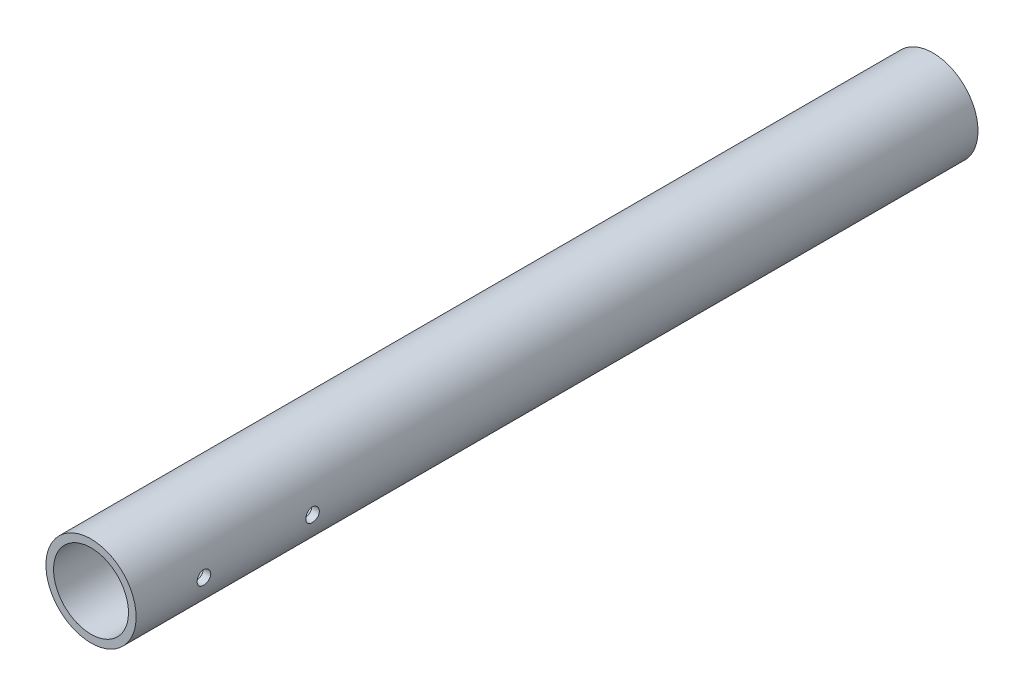
ISO-10303-21;
HEADER;
FILE_DESCRIPTION(('STEP AP214'),'2;1');
FILE_NAME('part.step','',(''),(''),'','','');
FILE_SCHEMA(('AUTOMOTIVE_DESIGN { 1 0 10303 214 1 1 1 1 }'));
ENDSEC;
DATA;
#1=APPLICATION_CONTEXT('core data for automotive mechanical design processes');
#2=APPLICATION_PROTOCOL_DEFINITION('international standard','automotive_design',2000,#1);
#3=PRODUCT_CONTEXT('',#1,'mechanical');
#4=PRODUCT('Part','Part','',(#3));
#5=PRODUCT_RELATED_PRODUCT_CATEGORY('part','',(#4));
#6=PRODUCT_DEFINITION_FORMATION('','',#4);
#7=PRODUCT_DEFINITION_CONTEXT('part definition',#1,'design');
#8=PRODUCT_DEFINITION('design','',#6,#7);
#9=PRODUCT_DEFINITION_SHAPE('','',#8);
#10=(LENGTH_UNIT() NAMED_UNIT(*) SI_UNIT(.MILLI.,.METRE.));
#11=(NAMED_UNIT(*) PLANE_ANGLE_UNIT() SI_UNIT($,.RADIAN.));
#12=(NAMED_UNIT(*) SI_UNIT($,.STERADIAN.) SOLID_ANGLE_UNIT());
#13=UNCERTAINTY_MEASURE_WITH_UNIT(LENGTH_MEASURE(1.E-05),#10,'distance_accuracy_value','');
#14=(GEOMETRIC_REPRESENTATION_CONTEXT(3) GLOBAL_UNCERTAINTY_ASSIGNED_CONTEXT((#13)) GLOBAL_UNIT_ASSIGNED_CONTEXT((#10,
#11,#12)) REPRESENTATION_CONTEXT('',''));
#15=CARTESIAN_POINT('',(0.,0.,0.));
#16=DIRECTION('',(0.,0.,1.));
#17=DIRECTION('',(1.,0.,0.));
#18=AXIS2_PLACEMENT_3D('',#15,#16,#17);
#19=CARTESIAN_POINT('',(0.,0.,0.));
#20=DIRECTION('',(0.,0.,1.));
#21=DIRECTION('',(1.,0.,0.));
#22=AXIS2_PLACEMENT_3D('',#19,#20,#21);
#23=CYLINDRICAL_SURFACE('',#22,17.526);
#24=CARTESIAN_POINT('',(0.,0.,393.7));
#25=DIRECTION('',(0.,0.,1.));
#26=DIRECTION('',(1.,0.,0.));
#27=AXIS2_PLACEMENT_3D('',#24,#25,#26);
#28=CIRCLE('',#27,17.526);
#29=CARTESIAN_POINT('',(17.526,0.,393.7));
#30=VERTEX_POINT('',#29);
#31=EDGE_CURVE('E18',#30,#30,#28,.F.);
#32=ORIENTED_EDGE('',*,*,#31,.F.);
#33=EDGE_LOOP('',(#32));
#34=FACE_BOUND('',#33,.T.);
#35=CARTESIAN_POINT('',(0.,0.,0.));
#36=DIRECTION('',(0.,0.,1.));
#37=DIRECTION('',(1.,0.,0.));
#38=AXIS2_PLACEMENT_3D('',#35,#36,#37);
#39=CIRCLE('',#38,17.526);
#40=CARTESIAN_POINT('',(17.526,0.,0.));
#41=VERTEX_POINT('',#40);
#42=EDGE_CURVE('E78',#41,#41,#39,.F.);
#43=ORIENTED_EDGE('',*,*,#42,.T.);
#44=EDGE_LOOP('',(#43));
#45=FACE_BOUND('',#44,.T.);
#46=CARTESIAN_POINT('',(17.526,0.,314.325));
#47=CARTESIAN_POINT('',(17.5259963175726,-0.176613181051217,314.324991723302));
#48=CARTESIAN_POINT('',(17.5233002826582,-0.353449171258817,314.310200668148));
#49=CARTESIAN_POINT('',(17.5127973362593,-0.702281908474051,314.251423100833));
#50=CARTESIAN_POINT('',(17.5049801575711,-0.874268208471723,314.207377935658));
#51=CARTESIAN_POINT('',(17.48511038614,-1.20810250721723,314.09147464681));
#52=CARTESIAN_POINT('',(17.473063368271,-1.36996352173552,314.019653119444));
#53=CARTESIAN_POINT('',(17.4460554580361,-1.67927316437237,313.850324943954));
#54=CARTESIAN_POINT('',(17.4310956012814,-1.82672688686375,313.752827420172));
#55=CARTESIAN_POINT('',(17.3997238299546,-2.10477719057218,313.533732397024));
#56=CARTESIAN_POINT('',(17.3832987194985,-2.23518750324315,313.411900352404));
#57=CARTESIAN_POINT('',(17.3509459564745,-2.4738411468331,313.14809368207));
#58=CARTESIAN_POINT('',(17.335018364459,-2.58208178835293,313.006116616098));
#59=CARTESIAN_POINT('',(17.3053385875312,-2.77407123838613,312.704766903283));
#60=CARTESIAN_POINT('',(17.2916032051447,-2.85763469507356,312.545274368621));
#61=CARTESIAN_POINT('',(17.2680458993697,-2.99671051245855,312.214226026226));
#62=CARTESIAN_POINT('',(17.2582236283197,-3.05222536525872,312.042671291755));
#63=CARTESIAN_POINT('',(17.2437354897132,-3.13304106760211,311.694333560972));
#64=CARTESIAN_POINT('',(17.2390149777777,-3.15866234519934,311.517627222411));
#65=CARTESIAN_POINT('',(17.2350999262051,-3.17995782709565,311.162365293601));
#66=CARTESIAN_POINT('',(17.2359049331653,-3.17563448853508,310.983809856282));
#67=CARTESIAN_POINT('',(17.2429001543548,-3.13742373793371,310.632230746528));
#68=CARTESIAN_POINT('',(17.2490242048828,-3.10389954139066,310.459166088615));
#69=CARTESIAN_POINT('',(17.2658637551246,-3.00880960849846,310.121157532169));
#70=CARTESIAN_POINT('',(17.276579474651,-2.94724252966902,309.956214022834));
#71=CARTESIAN_POINT('',(17.3014652665683,-2.79745291276667,309.638055892979));
#72=CARTESIAN_POINT('',(17.3156545368537,-2.70908155858381,309.484912899375));
#73=CARTESIAN_POINT('',(17.3458743890737,-2.50830442996264,309.195503775616));
#74=CARTESIAN_POINT('',(17.3619050065012,-2.39589819220297,309.059237970883));
#75=CARTESIAN_POINT('',(17.3942883351767,-2.14829928114741,308.805361728415));
#76=CARTESIAN_POINT('',(17.4106423451863,-2.01279967929529,308.688050627084));
#77=CARTESIAN_POINT('',(17.4416233292778,-1.72381393754225,308.477729015706));
#78=CARTESIAN_POINT('',(17.4562495353167,-1.57031985869497,308.38472929043));
#79=CARTESIAN_POINT('',(17.4821550853627,-1.24935860544027,308.22563859958));
#80=CARTESIAN_POINT('',(17.4934280108005,-1.08186540977745,308.159599150311));
#81=CARTESIAN_POINT('',(17.5112904348231,-0.738132155126105,308.056807400917));
#82=CARTESIAN_POINT('',(17.5178897862262,-0.561911340494518,308.019993467668));
#83=CARTESIAN_POINT('',(17.5231896350432,-0.320322833927916,307.990545032544));
#84=CARTESIAN_POINT('',(17.5242412276541,-0.256410066392405,307.984720466382));
#85=CARTESIAN_POINT('',(17.5256470796399,-0.128341342038203,307.976946444097));
#86=CARTESIAN_POINT('',(17.5260013382808,-0.064185384963603,307.974996992053));
#87=CARTESIAN_POINT('',(17.5259963175725,0.176613181051215,307.975008276698));
#88=CARTESIAN_POINT('',(17.5233002826582,0.353449171258822,307.989799331852));
#89=CARTESIAN_POINT('',(17.5127973362593,0.702281908474058,308.048576899167));
#90=CARTESIAN_POINT('',(17.5049801575711,0.874268208471724,308.092622064342));
#91=CARTESIAN_POINT('',(17.48511038614,1.20810250721723,308.20852535319));
#92=CARTESIAN_POINT('',(17.473063368271,1.36996352173552,308.280346880556));
#93=CARTESIAN_POINT('',(17.4460554580361,1.67927316437237,308.449675056046));
#94=CARTESIAN_POINT('',(17.4310956012814,1.82672688686375,308.547172579828));
#95=CARTESIAN_POINT('',(17.3997238299546,2.10477719057218,308.766267602976));
#96=CARTESIAN_POINT('',(17.3832987194985,2.23518750324315,308.888099647596));
#97=CARTESIAN_POINT('',(17.3509459564745,2.4738411468331,309.15190631793));
#98=CARTESIAN_POINT('',(17.335018364459,2.58208178835293,309.293883383902));
#99=CARTESIAN_POINT('',(17.3053385875312,2.77407123838613,309.595233096717));
#100=CARTESIAN_POINT('',(17.2916032051447,2.85763469507356,309.754725631379));
#101=CARTESIAN_POINT('',(17.2680458993697,2.99671051245855,310.085773973774));
#102=CARTESIAN_POINT('',(17.2582236283197,3.05222536525872,310.257328708245));
#103=CARTESIAN_POINT('',(17.2437354897132,3.13304106760211,310.605666439028));
#104=CARTESIAN_POINT('',(17.2390149777777,3.15866234519934,310.782372777589));
#105=CARTESIAN_POINT('',(17.2350999262051,3.17995782709565,311.137634706399));
#106=CARTESIAN_POINT('',(17.2359049331653,3.17563448853508,311.316190143718));
#107=CARTESIAN_POINT('',(17.2429001543548,3.13742373793371,311.667769253472));
#108=CARTESIAN_POINT('',(17.2490242048828,3.10389954139064,311.840833911385));
#109=CARTESIAN_POINT('',(17.2658637551246,3.00880960849844,312.178842467831));
#110=CARTESIAN_POINT('',(17.276579474651,2.947242529669,312.343785977166));
#111=CARTESIAN_POINT('',(17.3014652665683,2.79745291276668,312.661944107021));
#112=CARTESIAN_POINT('',(17.3156545368537,2.70908155858381,312.815087100625));
#113=CARTESIAN_POINT('',(17.3458743890737,2.50830442996264,313.104496224384));
#114=CARTESIAN_POINT('',(17.3619050065012,2.39589819220297,313.240762029117));
#115=CARTESIAN_POINT('',(17.3942883351767,2.14829928114741,313.494638271585));
#116=CARTESIAN_POINT('',(17.4106423451863,2.01279967929529,313.611949372916));
#117=CARTESIAN_POINT('',(17.4416233292778,1.72381393754225,313.822270984294));
#118=CARTESIAN_POINT('',(17.4562495353167,1.57031985869498,313.91527070957));
#119=CARTESIAN_POINT('',(17.4821550853627,1.24935860544028,314.07436140042));
#120=CARTESIAN_POINT('',(17.4934280108005,1.08186540977744,314.140400849689));
#121=CARTESIAN_POINT('',(17.5112904348231,0.738132155126103,314.243192599083));
#122=CARTESIAN_POINT('',(17.5178897862262,0.561911340494523,314.280006532332));
#123=CARTESIAN_POINT('',(17.5231896350432,0.320322833927918,314.309454967456));
#124=CARTESIAN_POINT('',(17.5242412276541,0.256410066392406,314.315279533618));
#125=CARTESIAN_POINT('',(17.5256470796399,0.1283413420382,314.323053555903));
#126=CARTESIAN_POINT('',(17.5260013382808,0.0641853849635972,314.325003007947));
#127=CARTESIAN_POINT('',(17.526,0.,314.325));
#128=B_SPLINE_CURVE_WITH_KNOTS('',3,(#46,#47,#48,#49,#50,#51,#52,#53,#54,#55,#56,#57,#58,#59,
#60,#61,#62,#63,#64,#65,#66,#67,#68,#69,#70,#71,#72,#73,#74,#75,#76,#77,#78,#79,#80,#81,#82,#83,
#84,#85,#86,#87,#88,#89,#90,#91,#92,#93,#94,#95,#96,#97,#98,#99,#100,#101,#102,#103,#104,#105,
#106,#107,#108,#109,#110,#111,#112,#113,#114,#115,#116,#117,#118,#119,#120,#121,#122,#123,#124,
#125,#126,#127),.UNSPECIFIED.,.T.,.F.,(4,2,2,2,2,2,2,2,2,2,2,2,2,2,2,2,2,2,2,2,2,2,2,2,2,2,2,2,
2,2,2,2,2,2,2,2,2,2,2,2,4),(0.,0.529594384353553,1.06025379692027,1.59021641642847,
2.11999095947089,2.6551421139281,3.19035814908337,3.72949754433927,4.26858902893715,
4.80184732449042,5.33506186343168,5.86173721299796,6.3884377784318,6.91811781642991,
7.44780806601106,7.98518312810164,8.52279617220148,9.06143174460417,9.59892835876537,
9.79139521459187,9.98386227300715,10.5134566573607,11.0441160699274,11.5740786894356,
12.103853232478,12.6390043869353,13.1742204220905,13.7133598173464,14.2524513019443,
14.7857095974976,15.3189241364388,15.8455994860052,16.372300051439,16.9019800894371,
17.4316703390182,17.9690454011088,18.5066584452086,19.0452940176113,19.5827906317725,
19.775257487599,19.9677245460143),.UNSPECIFIED.);
#129=CARTESIAN_POINT('',(17.526,0.,314.325));
#130=VERTEX_POINT('',#129);
#131=EDGE_CURVE('E72',#130,#130,#128,.T.);
#132=ORIENTED_EDGE('',*,*,#131,.T.);
#133=EDGE_LOOP('',(#132));
#134=FACE_BOUND('',#133,.T.);
#135=CARTESIAN_POINT('',(17.526,0.,365.125));
#136=CARTESIAN_POINT('',(17.5259963175726,-0.17661318105122,365.124991723302));
#137=CARTESIAN_POINT('',(17.5233002826582,-0.353449171258823,365.110200668148));
#138=CARTESIAN_POINT('',(17.5127973362593,-0.702281908474057,365.051423100833));
#139=CARTESIAN_POINT('',(17.5049801575711,-0.874268208471725,365.007377935658));
#140=CARTESIAN_POINT('',(17.48511038614,-1.20810250721724,364.89147464681));
#141=CARTESIAN_POINT('',(17.473063368271,-1.36996352173554,364.819653119444));
#142=CARTESIAN_POINT('',(17.4460554580361,-1.67927316437239,364.650324943954));
#143=CARTESIAN_POINT('',(17.4310956012814,-1.82672688686375,364.552827420172));
#144=CARTESIAN_POINT('',(17.3997238299546,-2.10477719057217,364.333732397024));
#145=CARTESIAN_POINT('',(17.3832987194985,-2.23518750324313,364.211900352404));
#146=CARTESIAN_POINT('',(17.3509459564745,-2.47384114683309,363.94809368207));
#147=CARTESIAN_POINT('',(17.335018364459,-2.58208178835292,363.806116616098));
#148=CARTESIAN_POINT('',(17.3053385875312,-2.77407123838613,363.504766903283));
#149=CARTESIAN_POINT('',(17.2916032051447,-2.85763469507356,363.345274368621));
#150=CARTESIAN_POINT('',(17.2680458993697,-2.99671051245856,363.014226026226));
#151=CARTESIAN_POINT('',(17.2582236283197,-3.05222536525872,362.842671291755));
#152=CARTESIAN_POINT('',(17.2437354897132,-3.13304106760211,362.494333560972));
#153=CARTESIAN_POINT('',(17.2390149777777,-3.15866234519934,362.317627222411));
#154=CARTESIAN_POINT('',(17.2350999262051,-3.17995782709565,361.962365293601));
#155=CARTESIAN_POINT('',(17.2359049331653,-3.17563448853508,361.783809856282));
#156=CARTESIAN_POINT('',(17.2429001543548,-3.13742373793372,361.432230746528));
#157=CARTESIAN_POINT('',(17.2490242048828,-3.10389954139067,361.259166088615));
#158=CARTESIAN_POINT('',(17.2658637551246,-3.00880960849848,360.921157532169));
#159=CARTESIAN_POINT('',(17.276579474651,-2.94724252966902,360.756214022834));
#160=CARTESIAN_POINT('',(17.3014652665683,-2.79745291276667,360.438055892979));
#161=CARTESIAN_POINT('',(17.3156545368537,-2.70908155858381,360.284912899375));
#162=CARTESIAN_POINT('',(17.3458743890737,-2.50830442996264,359.995503775616));
#163=CARTESIAN_POINT('',(17.3619050065012,-2.39589819220297,359.859237970883));
#164=CARTESIAN_POINT('',(17.3942883351767,-2.14829928114741,359.605361728415));
#165=CARTESIAN_POINT('',(17.4106423451863,-2.01279967929529,359.488050627084));
#166=CARTESIAN_POINT('',(17.4416233292778,-1.72381393754225,359.277729015706));
#167=CARTESIAN_POINT('',(17.4562495353167,-1.57031985869497,359.18472929043));
#168=CARTESIAN_POINT('',(17.4821550853627,-1.24935860544027,359.02563859958));
#169=CARTESIAN_POINT('',(17.4934280108005,-1.08186540977744,358.959599150311));
#170=CARTESIAN_POINT('',(17.5112904348231,-0.738132155126094,358.856807400917));
#171=CARTESIAN_POINT('',(17.5178897862262,-0.561911340494513,358.819993467668));
#172=CARTESIAN_POINT('',(17.5231896350432,-0.320322833927916,358.790545032544));
#173=CARTESIAN_POINT('',(17.5242412276541,-0.256410066392405,358.784720466382));
#174=CARTESIAN_POINT('',(17.5256470796399,-0.128341342038203,358.776946444097));
#175=CARTESIAN_POINT('',(17.5260013382808,-0.0641853849636031,358.774996992053));
#176=CARTESIAN_POINT('',(17.5259963175725,0.176613181051212,358.775008276698));
#177=CARTESIAN_POINT('',(17.5233002826582,0.353449171258816,358.789799331852));
#178=CARTESIAN_POINT('',(17.5127973362593,0.702281908474051,358.848576899167));
#179=CARTESIAN_POINT('',(17.5049801575711,0.87426820847172,358.892622064342));
#180=CARTESIAN_POINT('',(17.48511038614,1.20810250721724,359.00852535319));
#181=CARTESIAN_POINT('',(17.473063368271,1.36996352173554,359.080346880556));
#182=CARTESIAN_POINT('',(17.4460554580361,1.67927316437239,359.249675056046));
#183=CARTESIAN_POINT('',(17.4310956012814,1.82672688686375,359.347172579828));
#184=CARTESIAN_POINT('',(17.3997238299546,2.10477719057219,359.566267602976));
#185=CARTESIAN_POINT('',(17.3832987194985,2.23518750324317,359.688099647596));
#186=CARTESIAN_POINT('',(17.3509459564745,2.47384114683312,359.95190631793));
#187=CARTESIAN_POINT('',(17.335018364459,2.58208178835294,360.093883383902));
#188=CARTESIAN_POINT('',(17.3053385875312,2.77407123838613,360.395233096718));
#189=CARTESIAN_POINT('',(17.2916032051447,2.85763469507356,360.554725631379));
#190=CARTESIAN_POINT('',(17.2680458993697,2.99671051245856,360.885773973774));
#191=CARTESIAN_POINT('',(17.2582236283197,3.05222536525873,361.057328708245));
#192=CARTESIAN_POINT('',(17.2437354897132,3.13304106760211,361.405666439028));
#193=CARTESIAN_POINT('',(17.2390149777777,3.15866234519934,361.582372777589));
#194=CARTESIAN_POINT('',(17.2350999262051,3.17995782709565,361.937634706399));
#195=CARTESIAN_POINT('',(17.2359049331653,3.17563448853508,362.116190143718));
#196=CARTESIAN_POINT('',(17.2429001543548,3.13742373793371,362.467769253472));
#197=CARTESIAN_POINT('',(17.2490242048829,3.10389954139064,362.640833911385));
#198=CARTESIAN_POINT('',(17.2658637551246,3.00880960849843,362.978842467831));
#199=CARTESIAN_POINT('',(17.276579474651,2.947242529669,363.143785977166));
#200=CARTESIAN_POINT('',(17.3014652665683,2.79745291276667,363.461944107021));
#201=CARTESIAN_POINT('',(17.3156545368537,2.70908155858378,363.615087100625));
#202=CARTESIAN_POINT('',(17.3458743890737,2.50830442996261,363.904496224384));
#203=CARTESIAN_POINT('',(17.3619050065012,2.39589819220297,364.040762029117));
#204=CARTESIAN_POINT('',(17.3942883351767,2.14829928114742,364.294638271585));
#205=CARTESIAN_POINT('',(17.4106423451863,2.0127996792953,364.411949372916));
#206=CARTESIAN_POINT('',(17.4416233292778,1.72381393754226,364.622270984294));
#207=CARTESIAN_POINT('',(17.4562495353167,1.57031985869499,364.71527070957));
#208=CARTESIAN_POINT('',(17.4821550853627,1.24935860544028,364.87436140042));
#209=CARTESIAN_POINT('',(17.4934280108005,1.08186540977744,364.940400849689));
#210=CARTESIAN_POINT('',(17.5112904348231,0.738132155126102,365.043192599083));
#211=CARTESIAN_POINT('',(17.5178897862262,0.561911340494522,365.080006532332));
#212=CARTESIAN_POINT('',(17.5231896350432,0.320322833927917,365.109454967456));
#213=CARTESIAN_POINT('',(17.5242412276541,0.256410066392404,365.115279533618));
#214=CARTESIAN_POINT('',(17.5256470796399,0.128341342038197,365.123053555903));
#215=CARTESIAN_POINT('',(17.5260013382808,0.0641853849635962,365.125003007947));
#216=CARTESIAN_POINT('',(17.526,0.,365.125));
#217=B_SPLINE_CURVE_WITH_KNOTS('',3,(#135,#136,#137,#138,#139,#140,#141,#142,#143,#144,#145,
#146,#147,#148,#149,#150,#151,#152,#153,#154,#155,#156,#157,#158,#159,#160,#161,#162,#163,#164,
#165,#166,#167,#168,#169,#170,#171,#172,#173,#174,#175,#176,#177,#178,#179,#180,#181,#182,#183,
#184,#185,#186,#187,#188,#189,#190,#191,#192,#193,#194,#195,#196,#197,#198,#199,#200,#201,#202,
#203,#204,#205,#206,#207,#208,#209,#210,#211,#212,#213,#214,#215,#216),.UNSPECIFIED.,.T.,.F.,(4,
2,2,2,2,2,2,2,2,2,2,2,2,2,2,2,2,2,2,2,2,2,2,2,2,2,2,2,2,2,2,2,2,2,2,2,2,2,2,2,4),(0.,
0.529594384353562,1.06025379692027,1.59021641642849,2.11999095947089,2.65514211392804,
3.19035814908338,3.72949754433928,4.26858902893715,4.80184732449042,5.33506186343169,
5.86173721299791,6.3884377784318,6.91811781642991,7.44780806601107,7.98518312810165,
8.52279617220148,9.06143174460419,9.59892835876537,9.79139521459188,9.98386227300715,
10.5134566573607,11.0441160699274,11.5740786894356,12.1038532324781,12.6390043869353,
13.1742204220905,13.7133598173464,14.2524513019443,14.7857095974976,15.3189241364388,
15.8455994860052,16.372300051439,16.9019800894371,17.4316703390182,17.9690454011087,
18.5066584452086,19.0452940176113,19.5827906317725,19.775257487599,19.9677245460143),.UNSPECIFIED.);
#218=CARTESIAN_POINT('',(17.526,0.,365.125));
#219=VERTEX_POINT('',#218);
#220=EDGE_CURVE('E77',#219,#219,#217,.T.);
#221=ORIENTED_EDGE('',*,*,#220,.T.);
#222=EDGE_LOOP('',(#221));
#223=FACE_BOUND('',#222,.T.);
#224=ADVANCED_FACE('F14',(#34,#45,#134,#223),#23,.F.);
#225=CARTESIAN_POINT('',(0.,0.,393.7));
#226=DIRECTION('',(0.,0.,1.));
#227=DIRECTION('',(1.,0.,0.));
#228=AXIS2_PLACEMENT_3D('',#225,#226,#227);
#229=PLANE('',#228);
#230=ORIENTED_EDGE('',*,*,#31,.T.);
#231=EDGE_LOOP('',(#230));
#232=FACE_BOUND('',#231,.T.);
#233=CARTESIAN_POINT('',(0.,0.,393.7));
#234=DIRECTION('',(0.,0.,1.));
#235=DIRECTION('',(1.,0.,0.));
#236=AXIS2_PLACEMENT_3D('',#233,#234,#235);
#237=CIRCLE('',#236,21.082);
#238=CARTESIAN_POINT('',(21.082,0.,393.7));
#239=VERTEX_POINT('',#238);
#240=EDGE_CURVE('E53',#239,#239,#237,.F.);
#241=ORIENTED_EDGE('',*,*,#240,.F.);
#242=EDGE_LOOP('',(#241));
#243=FACE_BOUND('',#242,.T.);
#244=ADVANCED_FACE('F65',(#232,#243),#229,.T.);
#245=CARTESIAN_POINT('',(0.,0.,0.));
#246=DIRECTION('',(0.,0.,1.));
#247=DIRECTION('',(1.,0.,0.));
#248=AXIS2_PLACEMENT_3D('',#245,#246,#247);
#249=PLANE('',#248);
#250=ORIENTED_EDGE('',*,*,#42,.F.);
#251=EDGE_LOOP('',(#250));
#252=FACE_BOUND('',#251,.T.);
#253=CARTESIAN_POINT('',(0.,0.,0.));
#254=DIRECTION('',(0.,0.,1.));
#255=DIRECTION('',(1.,0.,0.));
#256=AXIS2_PLACEMENT_3D('',#253,#254,#255);
#257=CIRCLE('',#256,21.082);
#258=CARTESIAN_POINT('',(21.082,0.,0.));
#259=VERTEX_POINT('',#258);
#260=EDGE_CURVE('E27',#259,#259,#257,.T.);
#261=ORIENTED_EDGE('',*,*,#260,.F.);
#262=EDGE_LOOP('',(#261));
#263=FACE_BOUND('',#262,.T.);
#264=ADVANCED_FACE('F60',(#252,#263),#249,.F.);
#265=CARTESIAN_POINT('',(0.,0.,311.15));
#266=DIRECTION('',(1.,0.,0.));
#267=DIRECTION('',(0.,0.,-1.));
#268=AXIS2_PLACEMENT_3D('',#265,#266,#267);
#269=CYLINDRICAL_SURFACE('',#268,3.175);
#270=ORIENTED_EDGE('',*,*,#131,.F.);
#271=EDGE_LOOP('',(#270));
#272=FACE_BOUND('',#271,.T.);
#273=CARTESIAN_POINT('',(21.082,0.,307.975));
#274=CARTESIAN_POINT('',(21.08199697693,-0.17709688232668,307.975008010368));
#275=CARTESIAN_POINT('',(21.0797432371457,-0.354422246181484,307.98987962863));
#276=CARTESIAN_POINT('',(21.0709639947796,-0.704244999090057,308.048992357156));
#277=CARTESIAN_POINT('',(21.0644297330762,-0.876731730624416,308.093293691309));
#278=CARTESIAN_POINT('',(21.0478236267626,-1.21157212719878,308.209916576821));
#279=CARTESIAN_POINT('',(21.0377559284511,-1.37393740737854,308.282205296689));
#280=CARTESIAN_POINT('',(21.0151978427835,-1.68416250683155,308.452677911167));
#281=CARTESIAN_POINT('',(21.0027084021292,-1.83202796044267,308.550851692226));
#282=CARTESIAN_POINT('',(20.9765823177096,-2.11031247055373,308.771151374218));
#283=CARTESIAN_POINT('',(20.9629381187472,-2.24059940402077,308.893443308759));
#284=CARTESIAN_POINT('',(20.9360989041358,-2.47889130977967,309.15815612125));
#285=CARTESIAN_POINT('',(20.9229039374157,-2.58689386136818,309.30057918317));
#286=CARTESIAN_POINT('',(20.8983859370743,-2.77804880392722,309.602379318754));
#287=CARTESIAN_POINT('',(20.8870724896658,-2.86107558124533,309.76183680048));
#288=CARTESIAN_POINT('',(20.8676999734321,-2.99911832257811,310.092631067207));
#289=CARTESIAN_POINT('',(20.8596406975045,-3.05413606920677,310.263967095418));
#290=CARTESIAN_POINT('',(20.8477621063255,-3.13419546665348,310.612286214704));
#291=CARTESIAN_POINT('',(20.8439112642446,-3.15946012056009,310.789216954801));
#292=CARTESIAN_POINT('',(20.8407898414214,-3.17998700169885,311.144845640065));
#293=CARTESIAN_POINT('',(20.8415190033561,-3.17525091449293,311.323543485386));
#294=CARTESIAN_POINT('',(20.8474463650272,-3.13609305999255,311.676055967361));
#295=CARTESIAN_POINT('',(20.8526071214054,-3.10192000349507,311.849898951723));
#296=CARTESIAN_POINT('',(20.8667577563942,-3.00524711666563,312.189356569077));
#297=CARTESIAN_POINT('',(20.8757477764901,-2.94274623966,312.35497089778));
#298=CARTESIAN_POINT('',(20.8965856584325,-2.79093104974242,312.674029881479));
#299=CARTESIAN_POINT('',(20.9084447970673,-2.70151058452643,312.827423259963));
#300=CARTESIAN_POINT('',(20.9336753486097,-2.49847766149159,313.117109939396));
#301=CARTESIAN_POINT('',(20.9470467424824,-2.38486550815859,313.253403455536));
#302=CARTESIAN_POINT('',(20.9739588701191,-2.13533197536228,313.506452795665));
#303=CARTESIAN_POINT('',(20.9874999699534,-1.99920089823695,313.62300187002));
#304=CARTESIAN_POINT('',(21.0131093792406,-1.70912894954015,313.831684321995));
#305=CARTESIAN_POINT('',(21.0251770223332,-1.55518008085437,313.923806674708));
#306=CARTESIAN_POINT('',(21.0464937025039,-1.23362225418932,314.081023003482));
#307=CARTESIAN_POINT('',(21.0557387492241,-1.06599437803164,314.146078761652));
#308=CARTESIAN_POINT('',(21.0703231912675,-0.722245530020103,314.246925293116));
#309=CARTESIAN_POINT('',(21.0756708320201,-0.546143333577574,314.282777868268));
#310=CARTESIAN_POINT('',(21.0798495375515,-0.307328662833126,314.310693304996));
#311=CARTESIAN_POINT('',(21.0806542771979,-0.245995981253082,314.316054107026));
#312=CARTESIAN_POINT('',(21.0817300341182,-0.123118072865918,314.323208848164));
#313=CARTESIAN_POINT('',(21.0820010510576,-0.0615728459255778,314.325002785036));
#314=CARTESIAN_POINT('',(21.08199697693,0.177096882326677,314.324991989632));
#315=CARTESIAN_POINT('',(21.0797432371457,0.354422246181485,314.31012037137));
#316=CARTESIAN_POINT('',(21.0709639947796,0.70424499909006,314.251007642844));
#317=CARTESIAN_POINT('',(21.0644297330762,0.876731730624416,314.206706308691));
#318=CARTESIAN_POINT('',(21.0478236267626,1.21157212719877,314.090083423179));
#319=CARTESIAN_POINT('',(21.0377559284511,1.37393740737852,314.017794703311));
#320=CARTESIAN_POINT('',(21.0151978427835,1.68416250683153,313.847322088833));
#321=CARTESIAN_POINT('',(21.0027084021292,1.83202796044266,313.749148307774));
#322=CARTESIAN_POINT('',(20.9765823177096,2.11031247055373,313.528848625782));
#323=CARTESIAN_POINT('',(20.9629381187472,2.24059940402077,313.406556691241));
#324=CARTESIAN_POINT('',(20.9360989041358,2.47889130977966,313.14184387875));
#325=CARTESIAN_POINT('',(20.9229039374157,2.58689386136818,312.99942081683));
#326=CARTESIAN_POINT('',(20.8983859370743,2.77804880392721,312.697620681246));
#327=CARTESIAN_POINT('',(20.8870724896658,2.86107558124532,312.53816319952));
#328=CARTESIAN_POINT('',(20.8676999734321,2.9991183225781,312.207368932793));
#329=CARTESIAN_POINT('',(20.8596406975045,3.05413606920677,312.036032904582));
#330=CARTESIAN_POINT('',(20.8477621063255,3.13419546665348,311.687713785296));
#331=CARTESIAN_POINT('',(20.8439112642446,3.15946012056009,311.510783045199));
#332=CARTESIAN_POINT('',(20.8407898414214,3.17998700169885,311.155154359935));
#333=CARTESIAN_POINT('',(20.8415190033561,3.17525091449293,310.976456514614));
#334=CARTESIAN_POINT('',(20.8474463650272,3.13609305999255,310.623944032639));
#335=CARTESIAN_POINT('',(20.8526071214054,3.10192000349509,310.450101048277));
#336=CARTESIAN_POINT('',(20.8667577563942,3.00524711666566,310.110643430923));
#337=CARTESIAN_POINT('',(20.8757477764901,2.94274623966001,309.94502910222));
#338=CARTESIAN_POINT('',(20.8965856584325,2.79093104974243,309.625970118521));
#339=CARTESIAN_POINT('',(20.9084447970673,2.70151058452646,309.472576740037));
#340=CARTESIAN_POINT('',(20.9336753486097,2.49847766149166,309.182890060604));
#341=CARTESIAN_POINT('',(20.9470467424824,2.38486550815865,309.046596544464));
#342=CARTESIAN_POINT('',(20.9739588701191,2.13533197536231,308.793547204335));
#343=CARTESIAN_POINT('',(20.9874999699534,1.99920089823697,308.67699812998));
#344=CARTESIAN_POINT('',(21.0131093792406,1.70912894954014,308.468315678005));
#345=CARTESIAN_POINT('',(21.0251770223332,1.55518008085435,308.376193325292));
#346=CARTESIAN_POINT('',(21.0464937025039,1.23362225418928,308.218976996517));
#347=CARTESIAN_POINT('',(21.0557387492241,1.0659943780316,308.153921238348));
#348=CARTESIAN_POINT('',(21.0703231912676,0.722245530020078,308.053074706884));
#349=CARTESIAN_POINT('',(21.0756708320201,0.546143333577566,308.017222131732));
#350=CARTESIAN_POINT('',(21.0798495375515,0.307328662833132,307.989306695004));
#351=CARTESIAN_POINT('',(21.0806542771979,0.245995981253086,307.983945892974));
#352=CARTESIAN_POINT('',(21.0817300341182,0.123118072865918,307.976791151836));
#353=CARTESIAN_POINT('',(21.0820010510576,0.0615728459255751,307.974997214964));
#354=CARTESIAN_POINT('',(21.082,0.,307.975));
#355=B_SPLINE_CURVE_WITH_KNOTS('',3,(#273,#274,#275,#276,#277,#278,#279,#280,#281,#282,#283,
#284,#285,#286,#287,#288,#289,#290,#291,#292,#293,#294,#295,#296,#297,#298,#299,#300,#301,#302,
#303,#304,#305,#306,#307,#308,#309,#310,#311,#312,#313,#314,#315,#316,#317,#318,#319,#320,#321,
#322,#323,#324,#325,#326,#327,#328,#329,#330,#331,#332,#333,#334,#335,#336,#337,#338,#339,#340,
#341,#342,#343,#344,#345,#346,#347,#348,#349,#350,#351,#352,#353,#354),.UNSPECIFIED.,.T.,.F.,(4,
2,2,2,2,2,2,2,2,2,2,2,2,2,2,2,2,2,2,2,2,2,2,2,2,2,2,2,2,2,2,2,2,2,2,2,2,2,2,2,4),(0.,
0.53105577794366,1.06320165039409,1.59472515452001,2.12604129410146,2.66115151001699,
3.19631982320995,3.73413637351611,4.27191869060596,4.80564407774988,5.33933947832746,
5.86856946465915,6.39781900689901,6.9291835073254,7.46054132019028,7.9971588191655,
8.53401810770137,9.07163288703761,9.60810694982833,9.79274371285329,9.9773805916262,
10.5084363695699,11.0405822420203,11.5721057461462,12.1034218857277,12.6385321016432,
13.1737004148361,13.7115169651422,14.2492992822322,14.7830246693761,15.3167200699537,
15.8459500562853,16.3751995985252,16.9065640989515,17.4379219118164,17.9745394107917,
18.5113986993276,19.0490134786638,19.5854875414545,19.7701243044795,19.9547611832524),.UNSPECIFIED.);
#356=CARTESIAN_POINT('',(21.082,0.,307.975));
#357=VERTEX_POINT('',#356);
#358=EDGE_CURVE('E22',#357,#357,#355,.T.);
#359=ORIENTED_EDGE('',*,*,#358,.F.);
#360=EDGE_LOOP('',(#359));
#361=FACE_BOUND('',#360,.T.);
#362=ADVANCED_FACE('F48',(#272,#361),#269,.F.);
#363=CARTESIAN_POINT('',(0.,0.,361.95));
#364=DIRECTION('',(1.,0.,0.));
#365=DIRECTION('',(0.,0.,-1.));
#366=AXIS2_PLACEMENT_3D('',#363,#364,#365);
#367=CYLINDRICAL_SURFACE('',#366,3.175);
#368=ORIENTED_EDGE('',*,*,#220,.F.);
#369=EDGE_LOOP('',(#368));
#370=FACE_BOUND('',#369,.T.);
#371=CARTESIAN_POINT('',(21.082,0.,358.775));
#372=CARTESIAN_POINT('',(21.08199697693,-0.17709688232668,358.775008010368));
#373=CARTESIAN_POINT('',(21.0797432371457,-0.354422246181484,358.78987962863));
#374=CARTESIAN_POINT('',(21.0709639947796,-0.704244999090057,358.848992357156));
#375=CARTESIAN_POINT('',(21.0644297330762,-0.876731730624416,358.893293691309));
#376=CARTESIAN_POINT('',(21.0478236267626,-1.21157212719878,359.009916576821));
#377=CARTESIAN_POINT('',(21.0377559284511,-1.37393740737854,359.082205296689));
#378=CARTESIAN_POINT('',(21.0151978427835,-1.68416250683155,359.252677911167));
#379=CARTESIAN_POINT('',(21.0027084021292,-1.83202796044267,359.350851692226));
#380=CARTESIAN_POINT('',(20.9765823177096,-2.11031247055373,359.571151374218));
#381=CARTESIAN_POINT('',(20.9629381187472,-2.24059940402077,359.693443308759));
#382=CARTESIAN_POINT('',(20.9360989041358,-2.47889130977967,359.95815612125));
#383=CARTESIAN_POINT('',(20.9229039374157,-2.58689386136818,360.10057918317));
#384=CARTESIAN_POINT('',(20.8983859370743,-2.77804880392722,360.402379318754));
#385=CARTESIAN_POINT('',(20.8870724896658,-2.86107558124533,360.56183680048));
#386=CARTESIAN_POINT('',(20.8676999734321,-2.99911832257811,360.892631067207));
#387=CARTESIAN_POINT('',(20.8596406975045,-3.05413606920677,361.063967095418));
#388=CARTESIAN_POINT('',(20.8477621063255,-3.13419546665348,361.412286214704));
#389=CARTESIAN_POINT('',(20.8439112642446,-3.15946012056009,361.589216954801));
#390=CARTESIAN_POINT('',(20.8407898414214,-3.17998700169885,361.944845640065));
#391=CARTESIAN_POINT('',(20.8415190033561,-3.17525091449293,362.123543485386));
#392=CARTESIAN_POINT('',(20.8474463650272,-3.13609305999255,362.476055967361));
#393=CARTESIAN_POINT('',(20.8526071214054,-3.10192000349507,362.649898951723));
#394=CARTESIAN_POINT('',(20.8667577563942,-3.00524711666562,362.989356569077));
#395=CARTESIAN_POINT('',(20.8757477764901,-2.94274623965999,363.15497089778));
#396=CARTESIAN_POINT('',(20.8965856584325,-2.79093104974243,363.474029881479));
#397=CARTESIAN_POINT('',(20.9084447970673,-2.70151058452645,363.627423259963));
#398=CARTESIAN_POINT('',(20.9336753486097,-2.49847766149162,363.917109939396));
#399=CARTESIAN_POINT('',(20.9470467424824,-2.3848655081586,364.053403455536));
#400=CARTESIAN_POINT('',(20.9739588701191,-2.13533197536227,364.306452795665));
#401=CARTESIAN_POINT('',(20.9874999699534,-1.99920089823695,364.42300187002));
#402=CARTESIAN_POINT('',(21.0131093792406,-1.70912894954015,364.631684321995));
#403=CARTESIAN_POINT('',(21.0251770223332,-1.55518008085438,364.723806674708));
#404=CARTESIAN_POINT('',(21.0464937025039,-1.23362225418932,364.881023003482));
#405=CARTESIAN_POINT('',(21.0557387492241,-1.06599437803164,364.946078761652));
#406=CARTESIAN_POINT('',(21.0703231912675,-0.722245530020103,365.046925293116));
#407=CARTESIAN_POINT('',(21.0756708320201,-0.546143333577574,365.082777868268));
#408=CARTESIAN_POINT('',(21.0798495375515,-0.307328662833127,365.110693304996));
#409=CARTESIAN_POINT('',(21.0806542771979,-0.245995981253084,365.116054107026));
#410=CARTESIAN_POINT('',(21.0817300341182,-0.12311807286592,365.123208848164));
#411=CARTESIAN_POINT('',(21.0820010510576,-0.0615728459255789,365.125002785036));
#412=CARTESIAN_POINT('',(21.08199697693,0.177096882326675,365.124991989632));
#413=CARTESIAN_POINT('',(21.0797432371457,0.354422246181479,365.11012037137));
#414=CARTESIAN_POINT('',(21.0709639947796,0.704244999090053,365.051007642844));
#415=CARTESIAN_POINT('',(21.0644297330762,0.876731730624413,365.006706308691));
#416=CARTESIAN_POINT('',(21.0478236267626,1.21157212719877,364.890083423179));
#417=CARTESIAN_POINT('',(21.0377559284511,1.37393740737852,364.817794703311));
#418=CARTESIAN_POINT('',(21.0151978427835,1.68416250683153,364.647322088833));
#419=CARTESIAN_POINT('',(21.0027084021292,1.83202796044265,364.549148307774));
#420=CARTESIAN_POINT('',(20.9765823177096,2.11031247055374,364.328848625782));
#421=CARTESIAN_POINT('',(20.9629381187472,2.24059940402079,364.206556691241));
#422=CARTESIAN_POINT('',(20.9360989041358,2.47889130977969,363.94184387875));
#423=CARTESIAN_POINT('',(20.9229039374157,2.58689386136819,363.79942081683));
#424=CARTESIAN_POINT('',(20.8983859370743,2.77804880392719,363.497620681246));
#425=CARTESIAN_POINT('',(20.8870724896658,2.8610755812453,363.33816319952));
#426=CARTESIAN_POINT('',(20.8676999734321,2.99911832257809,363.007368932793));
#427=CARTESIAN_POINT('',(20.8596406975045,3.05413606920676,362.836032904582));
#428=CARTESIAN_POINT('',(20.8477621063255,3.13419546665347,362.487713785296));
#429=CARTESIAN_POINT('',(20.8439112642446,3.15946012056008,362.310783045199));
#430=CARTESIAN_POINT('',(20.8407898414214,3.17998700169885,361.955154359935));
#431=CARTESIAN_POINT('',(20.8415190033561,3.17525091449293,361.776456514614));
#432=CARTESIAN_POINT('',(20.8474463650272,3.13609305999256,361.423944032639));
#433=CARTESIAN_POINT('',(20.8526071214054,3.1019200034951,361.250101048277));
#434=CARTESIAN_POINT('',(20.8667577563942,3.00524711666567,360.910643430923));
#435=CARTESIAN_POINT('',(20.8757477764901,2.94274623966001,360.74502910222));
#436=CARTESIAN_POINT('',(20.8965856584325,2.79093104974242,360.425970118521));
#437=CARTESIAN_POINT('',(20.9084447970673,2.70151058452645,360.272576740037));
#438=CARTESIAN_POINT('',(20.9336753486097,2.49847766149164,359.982890060604));
#439=CARTESIAN_POINT('',(20.9470467424824,2.38486550815863,359.846596544464));
#440=CARTESIAN_POINT('',(20.9739588701191,2.13533197536232,359.593547204335));
#441=CARTESIAN_POINT('',(20.9874999699534,1.99920089823699,359.47699812998));
#442=CARTESIAN_POINT('',(21.0131093792406,1.70912894954016,359.268315678005));
#443=CARTESIAN_POINT('',(21.0251770223332,1.55518008085436,359.176193325292));
#444=CARTESIAN_POINT('',(21.0464937025039,1.23362225418928,359.018976996517));
#445=CARTESIAN_POINT('',(21.0557387492241,1.06599437803161,358.953921238348));
#446=CARTESIAN_POINT('',(21.0703231912676,0.722245530020089,358.853074706884));
#447=CARTESIAN_POINT('',(21.0756708320201,0.546143333577571,358.817222131732));
#448=CARTESIAN_POINT('',(21.0798495375515,0.307328662833131,358.789306695004));
#449=CARTESIAN_POINT('',(21.0806542771979,0.245995981253086,358.783945892974));
#450=CARTESIAN_POINT('',(21.0817300341182,0.123118072865918,358.776791151836));
#451=CARTESIAN_POINT('',(21.0820010510576,0.0615728459255751,358.774997214964));
#452=CARTESIAN_POINT('',(21.082,0.,358.775));
#453=B_SPLINE_CURVE_WITH_KNOTS('',3,(#371,#372,#373,#374,#375,#376,#377,#378,#379,#380,#381,
#382,#383,#384,#385,#386,#387,#388,#389,#390,#391,#392,#393,#394,#395,#396,#397,#398,#399,#400,
#401,#402,#403,#404,#405,#406,#407,#408,#409,#410,#411,#412,#413,#414,#415,#416,#417,#418,#419,
#420,#421,#422,#423,#424,#425,#426,#427,#428,#429,#430,#431,#432,#433,#434,#435,#436,#437,#438,
#439,#440,#441,#442,#443,#444,#445,#446,#447,#448,#449,#450,#451,#452),.UNSPECIFIED.,.T.,.F.,(4,
2,2,2,2,2,2,2,2,2,2,2,2,2,2,2,2,2,2,2,2,2,2,2,2,2,2,2,2,2,2,2,2,2,2,2,2,2,2,2,4),(0.,
0.53105577794366,1.06320165039409,1.59472515452001,2.12604129410146,2.66115151001699,
3.19631982320995,3.73413637351611,4.27191869060596,4.80564407774993,5.33933947832746,
5.86856946465921,6.39781900689901,6.92918350732539,7.46054132019028,7.99715881916551,
8.53401810770137,9.07163288703761,9.60810694982833,9.79274371285329,9.9773805916262,
10.5084363695699,11.0405822420203,11.5721057461462,12.1034218857277,12.6385321016432,
13.1737004148362,13.7115169651422,14.2492992822322,14.783024669376,15.3167200699537,
15.8459500562852,16.3751995985252,16.9065640989516,17.4379219118164,17.9745394107917,
18.5113986993277,19.0490134786639,19.5854875414545,19.7701243044795,19.9547611832524),.UNSPECIFIED.);
#454=CARTESIAN_POINT('',(21.082,0.,358.775));
#455=VERTEX_POINT('',#454);
#456=EDGE_CURVE('E10',#455,#455,#453,.T.);
#457=ORIENTED_EDGE('',*,*,#456,.F.);
#458=EDGE_LOOP('',(#457));
#459=FACE_BOUND('',#458,.T.);
#460=ADVANCED_FACE('F37',(#370,#459),#367,.F.);
#461=CARTESIAN_POINT('',(0.,0.,0.));
#462=DIRECTION('',(0.,0.,1.));
#463=DIRECTION('',(1.,0.,0.));
#464=AXIS2_PLACEMENT_3D('',#461,#462,#463);
#465=CYLINDRICAL_SURFACE('',#464,21.082);
#466=ORIENTED_EDGE('',*,*,#240,.T.);
#467=EDGE_LOOP('',(#466));
#468=FACE_BOUND('',#467,.T.);
#469=ORIENTED_EDGE('',*,*,#260,.T.);
#470=EDGE_LOOP('',(#469));
#471=FACE_BOUND('',#470,.T.);
#472=ORIENTED_EDGE('',*,*,#358,.T.);
#473=EDGE_LOOP('',(#472));
#474=FACE_BOUND('',#473,.T.);
#475=ORIENTED_EDGE('',*,*,#456,.T.);
#476=EDGE_LOOP('',(#475));
#477=FACE_BOUND('',#476,.T.);
#478=ADVANCED_FACE('F39',(#468,#471,#474,#477),#465,.T.);
#479=CLOSED_SHELL('',(#224,#244,#264,#362,#460,#478));
#480=MANIFOLD_SOLID_BREP('B1',#479);
#481=ADVANCED_BREP_SHAPE_REPRESENTATION('',(#18,#480),#14);
#482=SHAPE_DEFINITION_REPRESENTATION(#9,#481);
ENDSEC;
END-ISO-10303-21;
